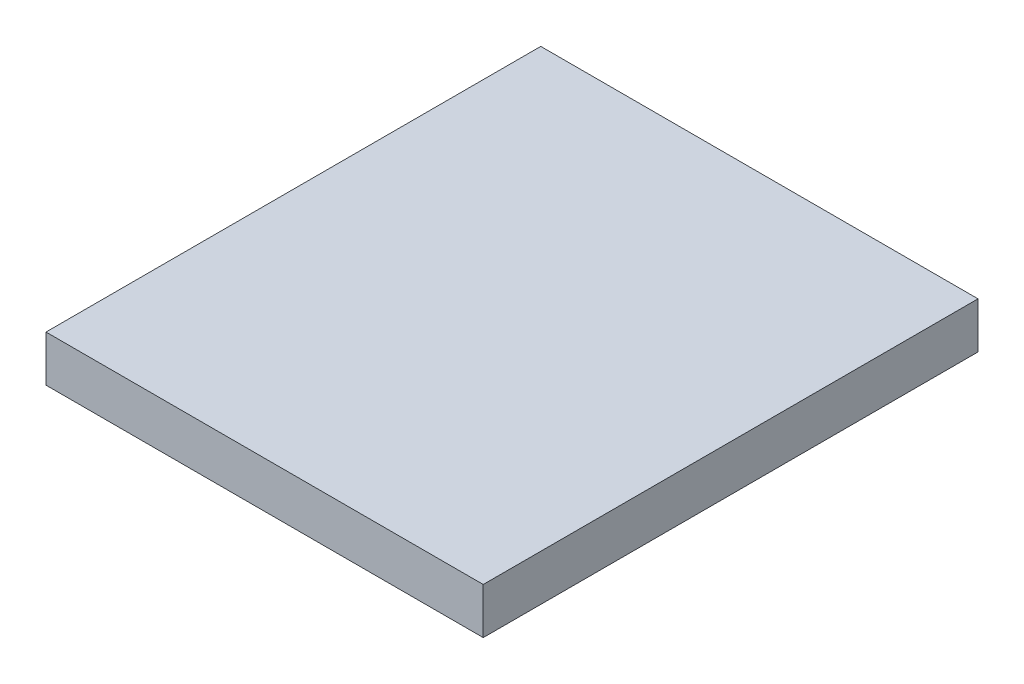
ISO-10303-21;
HEADER;
FILE_DESCRIPTION(('STEP AP214'),'2;1');
FILE_NAME('part.step','',(''),(''),'','','');
FILE_SCHEMA(('AUTOMOTIVE_DESIGN { 1 0 10303 214 1 1 1 1 }'));
ENDSEC;
DATA;
#1=APPLICATION_CONTEXT('core data for automotive mechanical design processes');
#2=APPLICATION_PROTOCOL_DEFINITION('international standard','automotive_design',2000,#1);
#3=PRODUCT_CONTEXT('',#1,'mechanical');
#4=PRODUCT('Part','Part','',(#3));
#5=PRODUCT_RELATED_PRODUCT_CATEGORY('part','',(#4));
#6=PRODUCT_DEFINITION_FORMATION('','',#4);
#7=PRODUCT_DEFINITION_CONTEXT('part definition',#1,'design');
#8=PRODUCT_DEFINITION('design','',#6,#7);
#9=PRODUCT_DEFINITION_SHAPE('','',#8);
#10=(LENGTH_UNIT() NAMED_UNIT(*) SI_UNIT(.MILLI.,.METRE.));
#11=(NAMED_UNIT(*) PLANE_ANGLE_UNIT() SI_UNIT($,.RADIAN.));
#12=(NAMED_UNIT(*) SI_UNIT($,.STERADIAN.) SOLID_ANGLE_UNIT());
#13=UNCERTAINTY_MEASURE_WITH_UNIT(LENGTH_MEASURE(1.E-05),#10,'distance_accuracy_value','');
#14=(GEOMETRIC_REPRESENTATION_CONTEXT(3) GLOBAL_UNCERTAINTY_ASSIGNED_CONTEXT((#13)) GLOBAL_UNIT_ASSIGNED_CONTEXT((#10,
#11,#12)) REPRESENTATION_CONTEXT('',''));
#15=CARTESIAN_POINT('',(0.,0.,0.));
#16=DIRECTION('',(0.,0.,1.));
#17=DIRECTION('',(1.,0.,0.));
#18=AXIS2_PLACEMENT_3D('',#15,#16,#17);
#19=CARTESIAN_POINT('',(38.,4.,0.));
#20=DIRECTION('',(0.,0.,-1.));
#21=DIRECTION('',(-1.,0.,0.));
#22=AXIS2_PLACEMENT_3D('',#19,#20,#21);
#23=PLANE('',#22);
#24=DIRECTION('',(1.,0.,0.));
#25=VECTOR('',#24,1.);
#26=CARTESIAN_POINT('',(38.,0.,0.));
#27=LINE('',#26,#25);
#28=CARTESIAN_POINT('',(0.,0.,0.));
#29=VERTEX_POINT('',#28);
#30=CARTESIAN_POINT('',(38.,0.,0.));
#31=VERTEX_POINT('',#30);
#32=EDGE_CURVE('E96',#29,#31,#27,.T.);
#33=ORIENTED_EDGE('',*,*,#32,.T.);
#34=DIRECTION('',(0.,-1.,0.));
#35=VECTOR('',#34,1.);
#36=CARTESIAN_POINT('',(38.,4.,0.));
#37=LINE('',#36,#35);
#38=CARTESIAN_POINT('',(38.,4.,0.));
#39=VERTEX_POINT('',#38);
#40=EDGE_CURVE('E11',#39,#31,#37,.T.);
#41=ORIENTED_EDGE('',*,*,#40,.F.);
#42=DIRECTION('',(1.,0.,0.));
#43=VECTOR('',#42,1.);
#44=CARTESIAN_POINT('',(38.,4.,0.));
#45=LINE('',#44,#43);
#46=CARTESIAN_POINT('',(0.,4.,0.));
#47=VERTEX_POINT('',#46);
#48=EDGE_CURVE('E84',#47,#39,#45,.T.);
#49=ORIENTED_EDGE('',*,*,#48,.F.);
#50=DIRECTION('',(0.,-1.,0.));
#51=VECTOR('',#50,1.);
#52=CARTESIAN_POINT('',(0.,4.,0.));
#53=LINE('',#52,#51);
#54=EDGE_CURVE('E92',#47,#29,#53,.T.);
#55=ORIENTED_EDGE('',*,*,#54,.T.);
#56=EDGE_LOOP('',(#33,#41,#49,#55));
#57=FACE_BOUND('',#56,.T.);
#58=ADVANCED_FACE('F33',(#57),#23,.F.);
#59=CARTESIAN_POINT('',(38.,4.,-43.));
#60=DIRECTION('',(-1.,0.,0.));
#61=DIRECTION('',(0.,0.,1.));
#62=AXIS2_PLACEMENT_3D('',#59,#60,#61);
#63=PLANE('',#62);
#64=DIRECTION('',(0.,0.,-1.));
#65=VECTOR('',#64,1.);
#66=CARTESIAN_POINT('',(38.,0.,-43.));
#67=LINE('',#66,#65);
#68=CARTESIAN_POINT('',(38.,0.,-43.));
#69=VERTEX_POINT('',#68);
#70=EDGE_CURVE('E88',#31,#69,#67,.T.);
#71=ORIENTED_EDGE('',*,*,#70,.T.);
#72=DIRECTION('',(0.,-1.,0.));
#73=VECTOR('',#72,1.);
#74=CARTESIAN_POINT('',(38.,4.,-43.));
#75=LINE('',#74,#73);
#76=CARTESIAN_POINT('',(38.,4.,-43.));
#77=VERTEX_POINT('',#76);
#78=EDGE_CURVE('E41',#77,#69,#75,.T.);
#79=ORIENTED_EDGE('',*,*,#78,.F.);
#80=DIRECTION('',(0.,0.,-1.));
#81=VECTOR('',#80,1.);
#82=CARTESIAN_POINT('',(38.,4.,-43.));
#83=LINE('',#82,#81);
#84=EDGE_CURVE('E79',#39,#77,#83,.T.);
#85=ORIENTED_EDGE('',*,*,#84,.F.);
#86=ORIENTED_EDGE('',*,*,#40,.T.);
#87=EDGE_LOOP('',(#71,#79,#85,#86));
#88=FACE_BOUND('',#87,.T.);
#89=ADVANCED_FACE('F87',(#88),#63,.F.);
#90=CARTESIAN_POINT('',(0.,4.,-43.));
#91=DIRECTION('',(0.,0.,1.));
#92=DIRECTION('',(1.,0.,0.));
#93=AXIS2_PLACEMENT_3D('',#90,#91,#92);
#94=PLANE('',#93);
#95=DIRECTION('',(-1.,0.,0.));
#96=VECTOR('',#95,1.);
#97=CARTESIAN_POINT('',(0.,0.,-43.));
#98=LINE('',#97,#96);
#99=CARTESIAN_POINT('',(0.,0.,-43.));
#100=VERTEX_POINT('',#99);
#101=EDGE_CURVE('E66',#69,#100,#98,.T.);
#102=ORIENTED_EDGE('',*,*,#101,.T.);
#103=DIRECTION('',(0.,-1.,0.));
#104=VECTOR('',#103,1.);
#105=CARTESIAN_POINT('',(0.,4.,-43.));
#106=LINE('',#105,#104);
#107=CARTESIAN_POINT('',(0.,4.,-43.));
#108=VERTEX_POINT('',#107);
#109=EDGE_CURVE('E89',#108,#100,#106,.T.);
#110=ORIENTED_EDGE('',*,*,#109,.F.);
#111=DIRECTION('',(-1.,0.,0.));
#112=VECTOR('',#111,1.);
#113=CARTESIAN_POINT('',(0.,4.,-43.));
#114=LINE('',#113,#112);
#115=EDGE_CURVE('E82',#77,#108,#114,.T.);
#116=ORIENTED_EDGE('',*,*,#115,.F.);
#117=ORIENTED_EDGE('',*,*,#78,.T.);
#118=EDGE_LOOP('',(#102,#110,#116,#117));
#119=FACE_BOUND('',#118,.T.);
#120=ADVANCED_FACE('F90',(#119),#94,.F.);
#121=CARTESIAN_POINT('',(0.,4.,0.));
#122=DIRECTION('',(1.,0.,0.));
#123=DIRECTION('',(0.,0.,-1.));
#124=AXIS2_PLACEMENT_3D('',#121,#122,#123);
#125=PLANE('',#124);
#126=DIRECTION('',(0.,0.,1.));
#127=VECTOR('',#126,1.);
#128=CARTESIAN_POINT('',(0.,0.,0.));
#129=LINE('',#128,#127);
#130=EDGE_CURVE('E72',#100,#29,#129,.T.);
#131=ORIENTED_EDGE('',*,*,#130,.T.);
#132=ORIENTED_EDGE('',*,*,#54,.F.);
#133=DIRECTION('',(0.,0.,1.));
#134=VECTOR('',#133,1.);
#135=CARTESIAN_POINT('',(0.,4.,0.));
#136=LINE('',#135,#134);
#137=EDGE_CURVE('E49',#108,#47,#136,.T.);
#138=ORIENTED_EDGE('',*,*,#137,.F.);
#139=ORIENTED_EDGE('',*,*,#109,.T.);
#140=EDGE_LOOP('',(#131,#132,#138,#139));
#141=FACE_BOUND('',#140,.T.);
#142=ADVANCED_FACE('F103',(#141),#125,.F.);
#143=CARTESIAN_POINT('',(0.,4.,0.));
#144=DIRECTION('',(0.,-1.,0.));
#145=DIRECTION('',(0.,0.,-1.));
#146=AXIS2_PLACEMENT_3D('',#143,#144,#145);
#147=PLANE('',#146);
#148=ORIENTED_EDGE('',*,*,#48,.T.);
#149=ORIENTED_EDGE('',*,*,#84,.T.);
#150=ORIENTED_EDGE('',*,*,#115,.T.);
#151=ORIENTED_EDGE('',*,*,#137,.T.);
#152=EDGE_LOOP('',(#148,#149,#150,#151));
#153=FACE_BOUND('',#152,.T.);
#154=ADVANCED_FACE('F80',(#153),#147,.F.);
#155=CARTESIAN_POINT('',(0.,0.,0.));
#156=DIRECTION('',(0.,-1.,0.));
#157=DIRECTION('',(0.,0.,-1.));
#158=AXIS2_PLACEMENT_3D('',#155,#156,#157);
#159=PLANE('',#158);
#160=ORIENTED_EDGE('',*,*,#32,.F.);
#161=ORIENTED_EDGE('',*,*,#130,.F.);
#162=ORIENTED_EDGE('',*,*,#101,.F.);
#163=ORIENTED_EDGE('',*,*,#70,.F.);
#164=EDGE_LOOP('',(#160,#161,#162,#163));
#165=FACE_BOUND('',#164,.T.);
#166=ADVANCED_FACE('F106',(#165),#159,.T.);
#167=CLOSED_SHELL('',(#58,#89,#120,#142,#154,#166));
#168=MANIFOLD_SOLID_BREP('B2',#167);
#169=ADVANCED_BREP_SHAPE_REPRESENTATION('',(#18,#168),#14);
#170=SHAPE_DEFINITION_REPRESENTATION(#9,#169);
ENDSEC;
END-ISO-10303-21;
